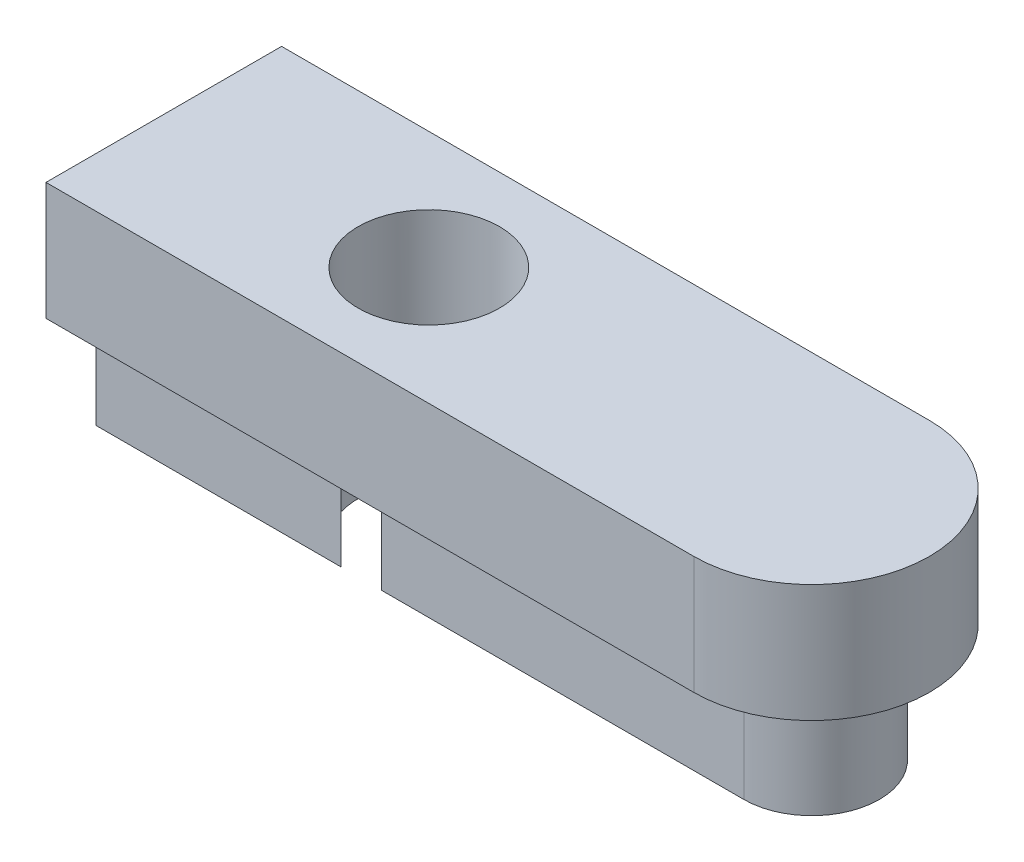
ISO-10303-21;
HEADER;
FILE_DESCRIPTION(('STEP AP214'),'2;1');
FILE_NAME('part.step','',(''),(''),'','','');
FILE_SCHEMA(('AUTOMOTIVE_DESIGN { 1 0 10303 214 1 1 1 1 }'));
ENDSEC;
DATA;
#1=APPLICATION_CONTEXT('core data for automotive mechanical design processes');
#2=APPLICATION_PROTOCOL_DEFINITION('international standard','automotive_design',2000,#1);
#3=PRODUCT_CONTEXT('',#1,'mechanical');
#4=PRODUCT('Part','Part','',(#3));
#5=PRODUCT_RELATED_PRODUCT_CATEGORY('part','',(#4));
#6=PRODUCT_DEFINITION_FORMATION('','',#4);
#7=PRODUCT_DEFINITION_CONTEXT('part definition',#1,'design');
#8=PRODUCT_DEFINITION('design','',#6,#7);
#9=PRODUCT_DEFINITION_SHAPE('','',#8);
#10=(LENGTH_UNIT() NAMED_UNIT(*) SI_UNIT(.MILLI.,.METRE.));
#11=(NAMED_UNIT(*) PLANE_ANGLE_UNIT() SI_UNIT($,.RADIAN.));
#12=(NAMED_UNIT(*) SI_UNIT($,.STERADIAN.) SOLID_ANGLE_UNIT());
#13=UNCERTAINTY_MEASURE_WITH_UNIT(LENGTH_MEASURE(1.E-05),#10,'distance_accuracy_value','');
#14=(GEOMETRIC_REPRESENTATION_CONTEXT(3) GLOBAL_UNCERTAINTY_ASSIGNED_CONTEXT((#13)) GLOBAL_UNIT_ASSIGNED_CONTEXT((#10,
#11,#12)) REPRESENTATION_CONTEXT('',''));
#15=CARTESIAN_POINT('',(0.,0.,0.));
#16=DIRECTION('',(0.,0.,1.));
#17=DIRECTION('',(1.,0.,0.));
#18=AXIS2_PLACEMENT_3D('',#15,#16,#17);
#19=CARTESIAN_POINT('',(-6.5,-2.,-1.15000000000001));
#20=DIRECTION('',(0.,0.,1.));
#21=DIRECTION('',(1.,0.,0.));
#22=AXIS2_PLACEMENT_3D('',#19,#20,#21);
#23=PLANE('',#22);
#24=DIRECTION('',(1.,0.,0.));
#25=VECTOR('',#24,1.);
#26=CARTESIAN_POINT('',(-6.5,-2.,-1.15000000000001));
#27=LINE('',#26,#25);
#28=CARTESIAN_POINT('',(-4.50000000000001,-2.,-1.15000000000001));
#29=VERTEX_POINT('',#28);
#30=CARTESIAN_POINT('',(-0.342782730020034,-2.,-1.15000000000001));
#31=VERTEX_POINT('',#30);
#32=EDGE_CURVE('E156',#29,#31,#27,.T.);
#33=ORIENTED_EDGE('',*,*,#32,.F.);
#34=DIRECTION('',(0.,1.,0.));
#35=VECTOR('',#34,1.);
#36=CARTESIAN_POINT('',(-4.50000000000001,-2.,-1.15000000000001));
#37=LINE('',#36,#35);
#38=CARTESIAN_POINT('',(-4.50000000000001,0.,-1.15000000000001));
#39=VERTEX_POINT('',#38);
#40=EDGE_CURVE('E57',#29,#39,#37,.T.);
#41=ORIENTED_EDGE('',*,*,#40,.T.);
#42=DIRECTION('',(1.,0.,0.));
#43=VECTOR('',#42,1.);
#44=CARTESIAN_POINT('',(-6.5,0.,-1.15000000000001));
#45=LINE('',#44,#43);
#46=CARTESIAN_POINT('',(-0.342782730020034,0.,-1.15000000000001));
#47=VERTEX_POINT('',#46);
#48=EDGE_CURVE('E160',#39,#47,#45,.T.);
#49=ORIENTED_EDGE('',*,*,#48,.T.);
#50=DIRECTION('',(0.,-1.,0.));
#51=VECTOR('',#50,1.);
#52=CARTESIAN_POINT('',(-0.342782730020034,2.,-1.15000000000001));
#53=LINE('',#52,#51);
#54=EDGE_CURVE('E211',#47,#31,#53,.T.);
#55=ORIENTED_EDGE('',*,*,#54,.T.);
#56=EDGE_LOOP('',(#33,#41,#49,#55));
#57=FACE_BOUND('',#56,.T.);
#58=ADVANCED_FACE('F42',(#57),#23,.F.);
#59=CARTESIAN_POINT('',(-6.5,-2.,1.15000000000001));
#60=DIRECTION('',(0.,0.,-1.));
#61=DIRECTION('',(-1.,0.,0.));
#62=AXIS2_PLACEMENT_3D('',#59,#60,#61);
#63=PLANE('',#62);
#64=DIRECTION('',(-1.,0.,0.));
#65=VECTOR('',#64,1.);
#66=CARTESIAN_POINT('',(-6.5,0.,1.15000000000001));
#67=LINE('',#66,#65);
#68=CARTESIAN_POINT('',(6.5,0.,1.15000000000001));
#69=VERTEX_POINT('',#68);
#70=CARTESIAN_POINT('',(0.342782730020026,0.,1.15000000000001));
#71=VERTEX_POINT('',#70);
#72=EDGE_CURVE('E168',#69,#71,#67,.T.);
#73=ORIENTED_EDGE('',*,*,#72,.T.);
#74=DIRECTION('',(0.,-1.,0.));
#75=VECTOR('',#74,1.);
#76=CARTESIAN_POINT('',(0.342782730020025,2.,1.15000000000001));
#77=LINE('',#76,#75);
#78=CARTESIAN_POINT('',(0.342782730020026,-2.,1.15000000000001));
#79=VERTEX_POINT('',#78);
#80=EDGE_CURVE('E246',#71,#79,#77,.T.);
#81=ORIENTED_EDGE('',*,*,#80,.T.);
#82=DIRECTION('',(-1.,0.,0.));
#83=VECTOR('',#82,1.);
#84=CARTESIAN_POINT('',(-6.5,-2.,1.15000000000001));
#85=LINE('',#84,#83);
#86=CARTESIAN_POINT('',(6.5,-2.,1.15000000000001));
#87=VERTEX_POINT('',#86);
#88=EDGE_CURVE('E149',#87,#79,#85,.T.);
#89=ORIENTED_EDGE('',*,*,#88,.F.);
#90=DIRECTION('',(0.,1.,0.));
#91=VECTOR('',#90,1.);
#92=CARTESIAN_POINT('',(6.5,-2.,1.15000000000001));
#93=LINE('',#92,#91);
#94=EDGE_CURVE('E155',#87,#69,#93,.T.);
#95=ORIENTED_EDGE('',*,*,#94,.T.);
#96=EDGE_LOOP('',(#73,#81,#89,#95));
#97=FACE_BOUND('',#96,.T.);
#98=ADVANCED_FACE('F245',(#97),#63,.F.);
#99=CARTESIAN_POINT('',(-6.5,-2.,0.));
#100=DIRECTION('',(0.,-1.,0.));
#101=DIRECTION('',(0.,0.,-1.));
#102=AXIS2_PLACEMENT_3D('',#99,#100,#101);
#103=PLANE('',#102);
#104=CARTESIAN_POINT('',(0.,-2.,0.));
#105=DIRECTION('',(0.,-1.,0.));
#106=DIRECTION('',(0.,0.,-1.));
#107=AXIS2_PLACEMENT_3D('',#104,#105,#106);
#108=CIRCLE('',#107,1.2);
#109=CARTESIAN_POINT('',(0.342782730020034,-2.,-1.15000000000001));
#110=VERTEX_POINT('',#109);
#111=EDGE_CURVE('E234',#110,#79,#108,.T.);
#112=ORIENTED_EDGE('',*,*,#111,.F.);
#113=CARTESIAN_POINT('',(6.5,-2.,-1.15));
#114=VERTEX_POINT('',#113);
#115=EDGE_CURVE('E172',#110,#114,#27,.T.);
#116=ORIENTED_EDGE('',*,*,#115,.T.);
#117=CARTESIAN_POINT('',(6.5,-2.,0.));
#118=DIRECTION('',(0.,-1.,0.));
#119=DIRECTION('',(0.,0.,-1.));
#120=AXIS2_PLACEMENT_3D('',#117,#118,#119);
#121=CIRCLE('',#120,1.15000000000001);
#122=EDGE_CURVE('E150',#114,#87,#121,.T.);
#123=ORIENTED_EDGE('',*,*,#122,.T.);
#124=ORIENTED_EDGE('',*,*,#88,.T.);
#125=EDGE_LOOP('',(#112,#116,#123,#124));
#126=FACE_BOUND('',#125,.T.);
#127=ADVANCED_FACE('F231',(#126),#103,.T.);
#128=CARTESIAN_POINT('',(-6.5,0.,0.));
#129=DIRECTION('',(0.,1.,0.));
#130=DIRECTION('',(0.,0.,1.));
#131=AXIS2_PLACEMENT_3D('',#128,#129,#130);
#132=PLANE('',#131);
#133=DIRECTION('',(1.,0.,0.));
#134=VECTOR('',#133,1.);
#135=CARTESIAN_POINT('',(-6.5,0.,2.));
#136=LINE('',#135,#134);
#137=CARTESIAN_POINT('',(-4.50000000000001,0.,2.));
#138=VERTEX_POINT('',#137);
#139=CARTESIAN_POINT('',(6.5,0.,2.));
#140=VERTEX_POINT('',#139);
#141=EDGE_CURVE('E180',#138,#140,#136,.T.);
#142=ORIENTED_EDGE('',*,*,#141,.F.);
#143=DIRECTION('',(0.,0.,-1.));
#144=VECTOR('',#143,1.);
#145=CARTESIAN_POINT('',(-4.50000000000001,0.,0.));
#146=LINE('',#145,#144);
#147=CARTESIAN_POINT('',(-4.50000000000001,0.,1.15000000000001));
#148=VERTEX_POINT('',#147);
#149=EDGE_CURVE('E144',#138,#148,#146,.T.);
#150=ORIENTED_EDGE('',*,*,#149,.T.);
#151=CARTESIAN_POINT('',(-0.342782730020025,0.,1.15000000000001));
#152=VERTEX_POINT('',#151);
#153=EDGE_CURVE('E142',#152,#148,#67,.T.);
#154=ORIENTED_EDGE('',*,*,#153,.F.);
#155=CARTESIAN_POINT('',(0.,0.,0.));
#156=DIRECTION('',(0.,1.,0.));
#157=DIRECTION('',(0.,0.,1.));
#158=AXIS2_PLACEMENT_3D('',#155,#156,#157);
#159=CIRCLE('',#158,1.2);
#160=EDGE_CURVE('E222',#152,#71,#159,.T.);
#161=ORIENTED_EDGE('',*,*,#160,.T.);
#162=ORIENTED_EDGE('',*,*,#72,.F.);
#163=CARTESIAN_POINT('',(6.5,0.,0.));
#164=DIRECTION('',(0.,-1.,0.));
#165=DIRECTION('',(0.,0.,-1.));
#166=AXIS2_PLACEMENT_3D('',#163,#164,#165);
#167=CIRCLE('',#166,1.15000000000001);
#168=CARTESIAN_POINT('',(6.5,0.,-1.15));
#169=VERTEX_POINT('',#168);
#170=EDGE_CURVE('E163',#169,#69,#167,.T.);
#171=ORIENTED_EDGE('',*,*,#170,.F.);
#172=CARTESIAN_POINT('',(0.342782730020034,0.,-1.15000000000001));
#173=VERTEX_POINT('',#172);
#174=EDGE_CURVE('E164',#173,#169,#45,.T.);
#175=ORIENTED_EDGE('',*,*,#174,.F.);
#176=EDGE_CURVE('E216',#173,#47,#159,.T.);
#177=ORIENTED_EDGE('',*,*,#176,.T.);
#178=ORIENTED_EDGE('',*,*,#48,.F.);
#179=CARTESIAN_POINT('',(-4.50000000000001,0.,-2.));
#180=VERTEX_POINT('',#179);
#181=EDGE_CURVE('E262',#39,#180,#146,.T.);
#182=ORIENTED_EDGE('',*,*,#181,.T.);
#183=DIRECTION('',(-1.,0.,0.));
#184=VECTOR('',#183,1.);
#185=CARTESIAN_POINT('',(-6.5,0.,-2.));
#186=LINE('',#185,#184);
#187=CARTESIAN_POINT('',(6.5,0.,-2.));
#188=VERTEX_POINT('',#187);
#189=EDGE_CURVE('E185',#188,#180,#186,.T.);
#190=ORIENTED_EDGE('',*,*,#189,.F.);
#191=CARTESIAN_POINT('',(6.5,0.,0.));
#192=DIRECTION('',(0.,1.,0.));
#193=DIRECTION('',(0.,0.,1.));
#194=AXIS2_PLACEMENT_3D('',#191,#192,#193);
#195=CIRCLE('',#194,2.);
#196=EDGE_CURVE('E195',#140,#188,#195,.T.);
#197=ORIENTED_EDGE('',*,*,#196,.F.);
#198=EDGE_LOOP('',(#142,#150,#154,#161,#162,#171,#175,#177,#178,#182,#190,#197));
#199=FACE_BOUND('',#198,.T.);
#200=ADVANCED_FACE('F293',(#199),#132,.F.);
#201=CARTESIAN_POINT('',(-6.5,2.,2.));
#202=DIRECTION('',(0.,0.,-1.));
#203=DIRECTION('',(-1.,0.,0.));
#204=AXIS2_PLACEMENT_3D('',#201,#202,#203);
#205=PLANE('',#204);
#206=DIRECTION('',(1.,0.,0.));
#207=VECTOR('',#206,1.);
#208=CARTESIAN_POINT('',(-6.5,2.,2.));
#209=LINE('',#208,#207);
#210=CARTESIAN_POINT('',(-4.50000000000001,2.,2.));
#211=VERTEX_POINT('',#210);
#212=CARTESIAN_POINT('',(6.5,2.,2.));
#213=VERTEX_POINT('',#212);
#214=EDGE_CURVE('E181',#211,#213,#209,.T.);
#215=ORIENTED_EDGE('',*,*,#214,.F.);
#216=DIRECTION('',(0.,-1.,0.));
#217=VECTOR('',#216,1.);
#218=CARTESIAN_POINT('',(-4.50000000000001,2.,2.));
#219=LINE('',#218,#217);
#220=EDGE_CURVE('E267',#211,#138,#219,.T.);
#221=ORIENTED_EDGE('',*,*,#220,.T.);
#222=ORIENTED_EDGE('',*,*,#141,.T.);
#223=DIRECTION('',(0.,-1.,0.));
#224=VECTOR('',#223,1.);
#225=CARTESIAN_POINT('',(6.5,2.,2.));
#226=LINE('',#225,#224);
#227=EDGE_CURVE('E204',#213,#140,#226,.T.);
#228=ORIENTED_EDGE('',*,*,#227,.F.);
#229=EDGE_LOOP('',(#215,#221,#222,#228));
#230=FACE_BOUND('',#229,.T.);
#231=ADVANCED_FACE('F44',(#230),#205,.F.);
#232=CARTESIAN_POINT('',(6.5,2.,0.));
#233=DIRECTION('',(0.,-1.,0.));
#234=DIRECTION('',(0.,0.,-1.));
#235=AXIS2_PLACEMENT_3D('',#232,#233,#234);
#236=CYLINDRICAL_SURFACE('',#235,2.);
#237=ORIENTED_EDGE('',*,*,#196,.T.);
#238=DIRECTION('',(0.,-1.,0.));
#239=VECTOR('',#238,1.);
#240=CARTESIAN_POINT('',(6.5,2.,-2.));
#241=LINE('',#240,#239);
#242=CARTESIAN_POINT('',(6.5,2.,-2.));
#243=VERTEX_POINT('',#242);
#244=EDGE_CURVE('E192',#243,#188,#241,.T.);
#245=ORIENTED_EDGE('',*,*,#244,.F.);
#246=CARTESIAN_POINT('',(6.5,2.,0.));
#247=DIRECTION('',(0.,1.,0.));
#248=DIRECTION('',(0.,0.,1.));
#249=AXIS2_PLACEMENT_3D('',#246,#247,#248);
#250=CIRCLE('',#249,2.);
#251=EDGE_CURVE('E184',#213,#243,#250,.T.);
#252=ORIENTED_EDGE('',*,*,#251,.F.);
#253=ORIENTED_EDGE('',*,*,#227,.T.);
#254=EDGE_LOOP('',(#237,#245,#252,#253));
#255=FACE_BOUND('',#254,.T.);
#256=ADVANCED_FACE('F287',(#255),#236,.T.);
#257=CARTESIAN_POINT('',(-6.5,2.,-2.));
#258=DIRECTION('',(0.,0.,1.));
#259=DIRECTION('',(1.,0.,0.));
#260=AXIS2_PLACEMENT_3D('',#257,#258,#259);
#261=PLANE('',#260);
#262=ORIENTED_EDGE('',*,*,#189,.T.);
#263=DIRECTION('',(0.,1.,0.));
#264=VECTOR('',#263,1.);
#265=CARTESIAN_POINT('',(-4.50000000000001,2.,-2.));
#266=LINE('',#265,#264);
#267=CARTESIAN_POINT('',(-4.50000000000001,2.,-2.));
#268=VERTEX_POINT('',#267);
#269=EDGE_CURVE('E263',#180,#268,#266,.T.);
#270=ORIENTED_EDGE('',*,*,#269,.T.);
#271=DIRECTION('',(-1.,0.,0.));
#272=VECTOR('',#271,1.);
#273=CARTESIAN_POINT('',(-6.5,2.,-2.));
#274=LINE('',#273,#272);
#275=EDGE_CURVE('E188',#243,#268,#274,.T.);
#276=ORIENTED_EDGE('',*,*,#275,.F.);
#277=ORIENTED_EDGE('',*,*,#244,.T.);
#278=EDGE_LOOP('',(#262,#270,#276,#277));
#279=FACE_BOUND('',#278,.T.);
#280=ADVANCED_FACE('F290',(#279),#261,.F.);
#281=CARTESIAN_POINT('',(-6.5,2.,0.));
#282=DIRECTION('',(0.,1.,0.));
#283=DIRECTION('',(0.,0.,1.));
#284=AXIS2_PLACEMENT_3D('',#281,#282,#283);
#285=PLANE('',#284);
#286=DIRECTION('',(0.,0.,1.));
#287=VECTOR('',#286,1.);
#288=CARTESIAN_POINT('',(-4.50000000000001,2.,-3.));
#289=LINE('',#288,#287);
#290=EDGE_CURVE('E145',#268,#211,#289,.T.);
#291=ORIENTED_EDGE('',*,*,#290,.T.);
#292=ORIENTED_EDGE('',*,*,#214,.T.);
#293=ORIENTED_EDGE('',*,*,#251,.T.);
#294=ORIENTED_EDGE('',*,*,#275,.T.);
#295=EDGE_LOOP('',(#291,#292,#293,#294));
#296=FACE_BOUND('',#295,.T.);
#297=CARTESIAN_POINT('',(0.,2.,0.));
#298=DIRECTION('',(0.,-1.,0.));
#299=DIRECTION('',(0.,0.,-1.));
#300=AXIS2_PLACEMENT_3D('',#297,#298,#299);
#301=CIRCLE('',#300,1.2);
#302=CARTESIAN_POINT('',(0.,2.,-1.2));
#303=VERTEX_POINT('',#302);
#304=EDGE_CURVE('E254',#303,#303,#301,.T.);
#305=ORIENTED_EDGE('',*,*,#304,.T.);
#306=EDGE_LOOP('',(#305));
#307=FACE_BOUND('',#306,.T.);
#308=ADVANCED_FACE('F277',(#296,#307),#285,.T.);
#309=ORIENTED_EDGE('',*,*,#115,.F.);
#310=DIRECTION('',(0.,-1.,0.));
#311=VECTOR('',#310,1.);
#312=CARTESIAN_POINT('',(0.342782730020034,2.,-1.15000000000001));
#313=LINE('',#312,#311);
#314=EDGE_CURVE('E220',#110,#173,#313,.F.);
#315=ORIENTED_EDGE('',*,*,#314,.T.);
#316=ORIENTED_EDGE('',*,*,#174,.T.);
#317=DIRECTION('',(0.,1.,0.));
#318=VECTOR('',#317,1.);
#319=CARTESIAN_POINT('',(6.5,-2.,-1.15));
#320=LINE('',#319,#318);
#321=EDGE_CURVE('E176',#114,#169,#320,.T.);
#322=ORIENTED_EDGE('',*,*,#321,.F.);
#323=EDGE_LOOP('',(#309,#315,#316,#322));
#324=FACE_BOUND('',#323,.T.);
#325=ADVANCED_FACE('F237',(#324),#23,.F.);
#326=CARTESIAN_POINT('',(6.5,-2.,0.));
#327=DIRECTION('',(0.,1.,0.));
#328=DIRECTION('',(0.,0.,1.));
#329=AXIS2_PLACEMENT_3D('',#326,#327,#328);
#330=CYLINDRICAL_SURFACE('',#329,1.15000000000001);
#331=ORIENTED_EDGE('',*,*,#170,.T.);
#332=ORIENTED_EDGE('',*,*,#94,.F.);
#333=ORIENTED_EDGE('',*,*,#122,.F.);
#334=ORIENTED_EDGE('',*,*,#321,.T.);
#335=EDGE_LOOP('',(#331,#332,#333,#334));
#336=FACE_BOUND('',#335,.T.);
#337=ADVANCED_FACE('F241',(#336),#330,.T.);
#338=ORIENTED_EDGE('',*,*,#153,.T.);
#339=DIRECTION('',(0.,-1.,0.));
#340=VECTOR('',#339,1.);
#341=CARTESIAN_POINT('',(-4.50000000000001,-2.,1.15000000000001));
#342=LINE('',#341,#340);
#343=CARTESIAN_POINT('',(-4.50000000000001,-2.,1.15000000000001));
#344=VERTEX_POINT('',#343);
#345=EDGE_CURVE('E131',#148,#344,#342,.T.);
#346=ORIENTED_EDGE('',*,*,#345,.T.);
#347=CARTESIAN_POINT('',(-0.342782730020027,-2.,1.15000000000001));
#348=VERTEX_POINT('',#347);
#349=EDGE_CURVE('E140',#348,#344,#85,.T.);
#350=ORIENTED_EDGE('',*,*,#349,.F.);
#351=DIRECTION('',(0.,-1.,0.));
#352=VECTOR('',#351,1.);
#353=CARTESIAN_POINT('',(-0.342782730020025,2.,1.15000000000001));
#354=LINE('',#353,#352);
#355=EDGE_CURVE('E65',#348,#152,#354,.F.);
#356=ORIENTED_EDGE('',*,*,#355,.T.);
#357=EDGE_LOOP('',(#338,#346,#350,#356));
#358=FACE_BOUND('',#357,.T.);
#359=ADVANCED_FACE('F139',(#358),#63,.F.);
#360=DIRECTION('',(0.,0.,1.));
#361=VECTOR('',#360,1.);
#362=CARTESIAN_POINT('',(-4.50000000000001,-2.,0.));
#363=LINE('',#362,#361);
#364=EDGE_CURVE('E11',#29,#344,#363,.T.);
#365=ORIENTED_EDGE('',*,*,#364,.F.);
#366=ORIENTED_EDGE('',*,*,#32,.T.);
#367=CARTESIAN_POINT('',(0.,-2.,0.));
#368=DIRECTION('',(0.,-1.,0.));
#369=DIRECTION('',(0.,0.,-1.));
#370=AXIS2_PLACEMENT_3D('',#367,#368,#369);
#371=CIRCLE('',#370,1.2);
#372=EDGE_CURVE('E51',#348,#31,#371,.T.);
#373=ORIENTED_EDGE('',*,*,#372,.F.);
#374=ORIENTED_EDGE('',*,*,#349,.T.);
#375=EDGE_LOOP('',(#365,#366,#373,#374));
#376=FACE_BOUND('',#375,.T.);
#377=ADVANCED_FACE('F147',(#376),#103,.T.);
#378=CARTESIAN_POINT('',(0.,2.,0.));
#379=DIRECTION('',(0.,-1.,0.));
#380=DIRECTION('',(0.,0.,-1.));
#381=AXIS2_PLACEMENT_3D('',#378,#379,#380);
#382=CYLINDRICAL_SURFACE('',#381,1.2);
#383=ORIENTED_EDGE('',*,*,#304,.F.);
#384=EDGE_LOOP('',(#383));
#385=FACE_BOUND('',#384,.T.);
#386=ORIENTED_EDGE('',*,*,#176,.F.);
#387=ORIENTED_EDGE('',*,*,#314,.F.);
#388=ORIENTED_EDGE('',*,*,#111,.T.);
#389=ORIENTED_EDGE('',*,*,#80,.F.);
#390=ORIENTED_EDGE('',*,*,#160,.F.);
#391=ORIENTED_EDGE('',*,*,#355,.F.);
#392=ORIENTED_EDGE('',*,*,#372,.T.);
#393=ORIENTED_EDGE('',*,*,#54,.F.);
#394=EDGE_LOOP('',(#386,#387,#388,#389,#390,#391,#392,#393));
#395=FACE_BOUND('',#394,.T.);
#396=ADVANCED_FACE('F210',(#385,#395),#382,.F.);
#397=CARTESIAN_POINT('',(-4.50000000000001,2.,-3.));
#398=DIRECTION('',(1.,0.,0.));
#399=DIRECTION('',(0.,0.,-1.));
#400=AXIS2_PLACEMENT_3D('',#397,#398,#399);
#401=PLANE('',#400);
#402=ORIENTED_EDGE('',*,*,#364,.T.);
#403=ORIENTED_EDGE('',*,*,#345,.F.);
#404=ORIENTED_EDGE('',*,*,#149,.F.);
#405=ORIENTED_EDGE('',*,*,#220,.F.);
#406=ORIENTED_EDGE('',*,*,#290,.F.);
#407=ORIENTED_EDGE('',*,*,#269,.F.);
#408=ORIENTED_EDGE('',*,*,#181,.F.);
#409=ORIENTED_EDGE('',*,*,#40,.F.);
#410=EDGE_LOOP('',(#402,#403,#404,#405,#406,#407,#408,#409));
#411=FACE_BOUND('',#410,.T.);
#412=ADVANCED_FACE('F130',(#411),#401,.F.);
#413=CLOSED_SHELL('',(#58,#98,#127,#200,#231,#256,#280,#308,#325,#337,#359,#377,#396,#412));
#414=MANIFOLD_SOLID_BREP('B2',#413);
#415=ADVANCED_BREP_SHAPE_REPRESENTATION('',(#18,#414),#14);
#416=SHAPE_DEFINITION_REPRESENTATION(#9,#415);
ENDSEC;
END-ISO-10303-21;
